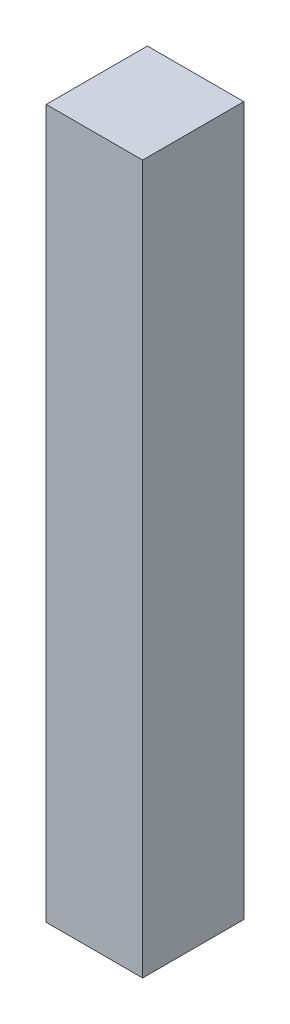
ISO-10303-21;
HEADER;
FILE_DESCRIPTION(('STEP AP214'),'2;1');
FILE_NAME('part.step','',(''),(''),'','','');
FILE_SCHEMA(('AUTOMOTIVE_DESIGN { 1 0 10303 214 1 1 1 1 }'));
ENDSEC;
DATA;
#1=APPLICATION_CONTEXT('core data for automotive mechanical design processes');
#2=APPLICATION_PROTOCOL_DEFINITION('international standard','automotive_design',2000,#1);
#3=PRODUCT_CONTEXT('',#1,'mechanical');
#4=PRODUCT('Part','Part','',(#3));
#5=PRODUCT_RELATED_PRODUCT_CATEGORY('part','',(#4));
#6=PRODUCT_DEFINITION_FORMATION('','',#4);
#7=PRODUCT_DEFINITION_CONTEXT('part definition',#1,'design');
#8=PRODUCT_DEFINITION('design','',#6,#7);
#9=PRODUCT_DEFINITION_SHAPE('','',#8);
#10=(LENGTH_UNIT() NAMED_UNIT(*) SI_UNIT(.MILLI.,.METRE.));
#11=(NAMED_UNIT(*) PLANE_ANGLE_UNIT() SI_UNIT($,.RADIAN.));
#12=(NAMED_UNIT(*) SI_UNIT($,.STERADIAN.) SOLID_ANGLE_UNIT());
#13=UNCERTAINTY_MEASURE_WITH_UNIT(LENGTH_MEASURE(1.E-05),#10,'distance_accuracy_value','');
#14=(GEOMETRIC_REPRESENTATION_CONTEXT(3) GLOBAL_UNCERTAINTY_ASSIGNED_CONTEXT((#13)) GLOBAL_UNIT_ASSIGNED_CONTEXT((#10,
#11,#12)) REPRESENTATION_CONTEXT('',''));
#15=CARTESIAN_POINT('',(0.,0.,0.));
#16=DIRECTION('',(0.,0.,1.));
#17=DIRECTION('',(1.,0.,0.));
#18=AXIS2_PLACEMENT_3D('',#15,#16,#17);
#19=CARTESIAN_POINT('',(0.1905,1.39999974,0.3999992));
#20=DIRECTION('',(0.,0.,1.));
#21=DIRECTION('',(1.,0.,0.));
#22=AXIS2_PLACEMENT_3D('',#19,#20,#21);
#23=PLANE('',#22);
#24=DIRECTION('',(1.,0.,0.));
#25=VECTOR('',#24,1.);
#26=CARTESIAN_POINT('',(-0.1905,1.39999974,0.3999992));
#27=LINE('',#26,#25);
#28=CARTESIAN_POINT('',(-0.1905,1.39999974,0.3999992));
#29=VERTEX_POINT('',#28);
#30=CARTESIAN_POINT('',(0.1905,1.39999974,0.3999992));
#31=VERTEX_POINT('',#30);
#32=EDGE_CURVE('E20',#29,#31,#27,.T.);
#33=ORIENTED_EDGE('',*,*,#32,.F.);
#34=DIRECTION('',(0.,1.,0.));
#35=VECTOR('',#34,1.);
#36=CARTESIAN_POINT('',(-0.1905,-1.39999974,0.3999992));
#37=LINE('',#36,#35);
#38=CARTESIAN_POINT('',(-0.1905,-1.39999974,0.3999992));
#39=VERTEX_POINT('',#38);
#40=EDGE_CURVE('E99',#39,#29,#37,.T.);
#41=ORIENTED_EDGE('',*,*,#40,.F.);
#42=DIRECTION('',(-1.,0.,0.));
#43=VECTOR('',#42,1.);
#44=CARTESIAN_POINT('',(0.1905,-1.39999974,0.3999992));
#45=LINE('',#44,#43);
#46=CARTESIAN_POINT('',(0.1905,-1.39999974,0.3999992));
#47=VERTEX_POINT('',#46);
#48=EDGE_CURVE('E84',#47,#39,#45,.T.);
#49=ORIENTED_EDGE('',*,*,#48,.F.);
#50=DIRECTION('',(0.,-1.,0.));
#51=VECTOR('',#50,1.);
#52=CARTESIAN_POINT('',(0.1905,1.39999974,0.3999992));
#53=LINE('',#52,#51);
#54=EDGE_CURVE('E88',#31,#47,#53,.T.);
#55=ORIENTED_EDGE('',*,*,#54,.F.);
#56=EDGE_LOOP('',(#33,#41,#49,#55));
#57=FACE_BOUND('',#56,.T.);
#58=ADVANCED_FACE('F17',(#57),#23,.T.);
#59=CARTESIAN_POINT('',(0.1905,1.39999974,0.));
#60=DIRECTION('',(0.,0.,1.));
#61=DIRECTION('',(1.,0.,0.));
#62=AXIS2_PLACEMENT_3D('',#59,#60,#61);
#63=PLANE('',#62);
#64=DIRECTION('',(0.,-1.,0.));
#65=VECTOR('',#64,1.);
#66=CARTESIAN_POINT('',(0.1905,1.39999974,0.));
#67=LINE('',#66,#65);
#68=CARTESIAN_POINT('',(0.1905,1.39999974,0.));
#69=VERTEX_POINT('',#68);
#70=CARTESIAN_POINT('',(0.1905,-1.39999974,0.));
#71=VERTEX_POINT('',#70);
#72=EDGE_CURVE('E72',#69,#71,#67,.T.);
#73=ORIENTED_EDGE('',*,*,#72,.T.);
#74=DIRECTION('',(-1.,0.,0.));
#75=VECTOR('',#74,1.);
#76=CARTESIAN_POINT('',(0.1905,-1.39999974,0.));
#77=LINE('',#76,#75);
#78=CARTESIAN_POINT('',(-0.1905,-1.39999974,0.));
#79=VERTEX_POINT('',#78);
#80=EDGE_CURVE('E96',#71,#79,#77,.T.);
#81=ORIENTED_EDGE('',*,*,#80,.T.);
#82=DIRECTION('',(0.,1.,0.));
#83=VECTOR('',#82,1.);
#84=CARTESIAN_POINT('',(-0.1905,-1.39999974,0.));
#85=LINE('',#84,#83);
#86=CARTESIAN_POINT('',(-0.1905,1.39999974,0.));
#87=VERTEX_POINT('',#86);
#88=EDGE_CURVE('E74',#79,#87,#85,.T.);
#89=ORIENTED_EDGE('',*,*,#88,.T.);
#90=DIRECTION('',(1.,0.,0.));
#91=VECTOR('',#90,1.);
#92=CARTESIAN_POINT('',(-0.1905,1.39999974,0.));
#93=LINE('',#92,#91);
#94=EDGE_CURVE('E11',#87,#69,#93,.T.);
#95=ORIENTED_EDGE('',*,*,#94,.T.);
#96=EDGE_LOOP('',(#73,#81,#89,#95));
#97=FACE_BOUND('',#96,.T.);
#98=ADVANCED_FACE('F70',(#97),#63,.F.);
#99=CARTESIAN_POINT('',(-0.1905,1.39999974,0.));
#100=DIRECTION('',(0.,1.,0.));
#101=DIRECTION('',(1.,0.,0.));
#102=AXIS2_PLACEMENT_3D('',#99,#100,#101);
#103=PLANE('',#102);
#104=DIRECTION('',(0.,0.,1.));
#105=VECTOR('',#104,1.);
#106=CARTESIAN_POINT('',(-0.1905,1.39999974,0.));
#107=LINE('',#106,#105);
#108=EDGE_CURVE('E103',#87,#29,#107,.T.);
#109=ORIENTED_EDGE('',*,*,#108,.T.);
#110=ORIENTED_EDGE('',*,*,#32,.T.);
#111=DIRECTION('',(0.,0.,1.));
#112=VECTOR('',#111,1.);
#113=CARTESIAN_POINT('',(0.1905,1.39999974,0.));
#114=LINE('',#113,#112);
#115=EDGE_CURVE('E80',#69,#31,#114,.T.);
#116=ORIENTED_EDGE('',*,*,#115,.F.);
#117=ORIENTED_EDGE('',*,*,#94,.F.);
#118=EDGE_LOOP('',(#109,#110,#116,#117));
#119=FACE_BOUND('',#118,.T.);
#120=ADVANCED_FACE('F86',(#119),#103,.T.);
#121=CARTESIAN_POINT('',(-0.1905,-1.39999974,0.));
#122=DIRECTION('',(-1.,0.,0.));
#123=DIRECTION('',(0.,0.,1.));
#124=AXIS2_PLACEMENT_3D('',#121,#122,#123);
#125=PLANE('',#124);
#126=DIRECTION('',(0.,0.,1.));
#127=VECTOR('',#126,1.);
#128=CARTESIAN_POINT('',(-0.1905,-1.39999974,0.));
#129=LINE('',#128,#127);
#130=EDGE_CURVE('E100',#79,#39,#129,.T.);
#131=ORIENTED_EDGE('',*,*,#130,.T.);
#132=ORIENTED_EDGE('',*,*,#40,.T.);
#133=ORIENTED_EDGE('',*,*,#108,.F.);
#134=ORIENTED_EDGE('',*,*,#88,.F.);
#135=EDGE_LOOP('',(#131,#132,#133,#134));
#136=FACE_BOUND('',#135,.T.);
#137=ADVANCED_FACE('F145',(#136),#125,.T.);
#138=CARTESIAN_POINT('',(0.1905,-1.39999974,0.));
#139=DIRECTION('',(0.,-1.,0.));
#140=DIRECTION('',(0.,0.,-1.));
#141=AXIS2_PLACEMENT_3D('',#138,#139,#140);
#142=PLANE('',#141);
#143=DIRECTION('',(0.,0.,1.));
#144=VECTOR('',#143,1.);
#145=CARTESIAN_POINT('',(0.1905,-1.39999974,0.));
#146=LINE('',#145,#144);
#147=EDGE_CURVE('E82',#71,#47,#146,.T.);
#148=ORIENTED_EDGE('',*,*,#147,.T.);
#149=ORIENTED_EDGE('',*,*,#48,.T.);
#150=ORIENTED_EDGE('',*,*,#130,.F.);
#151=ORIENTED_EDGE('',*,*,#80,.F.);
#152=EDGE_LOOP('',(#148,#149,#150,#151));
#153=FACE_BOUND('',#152,.T.);
#154=ADVANCED_FACE('F133',(#153),#142,.T.);
#155=CARTESIAN_POINT('',(0.1905,1.39999974,0.));
#156=DIRECTION('',(1.,0.,0.));
#157=DIRECTION('',(0.,1.,0.));
#158=AXIS2_PLACEMENT_3D('',#155,#156,#157);
#159=PLANE('',#158);
#160=ORIENTED_EDGE('',*,*,#115,.T.);
#161=ORIENTED_EDGE('',*,*,#54,.T.);
#162=ORIENTED_EDGE('',*,*,#147,.F.);
#163=ORIENTED_EDGE('',*,*,#72,.F.);
#164=EDGE_LOOP('',(#160,#161,#162,#163));
#165=FACE_BOUND('',#164,.T.);
#166=ADVANCED_FACE('F78',(#165),#159,.T.);
#167=CLOSED_SHELL('',(#58,#98,#120,#137,#154,#166));
#168=MANIFOLD_SOLID_BREP('B1',#167);
#169=ADVANCED_BREP_SHAPE_REPRESENTATION('',(#18,#168),#14);
#170=SHAPE_DEFINITION_REPRESENTATION(#9,#169);
ENDSEC;
END-ISO-10303-21;
